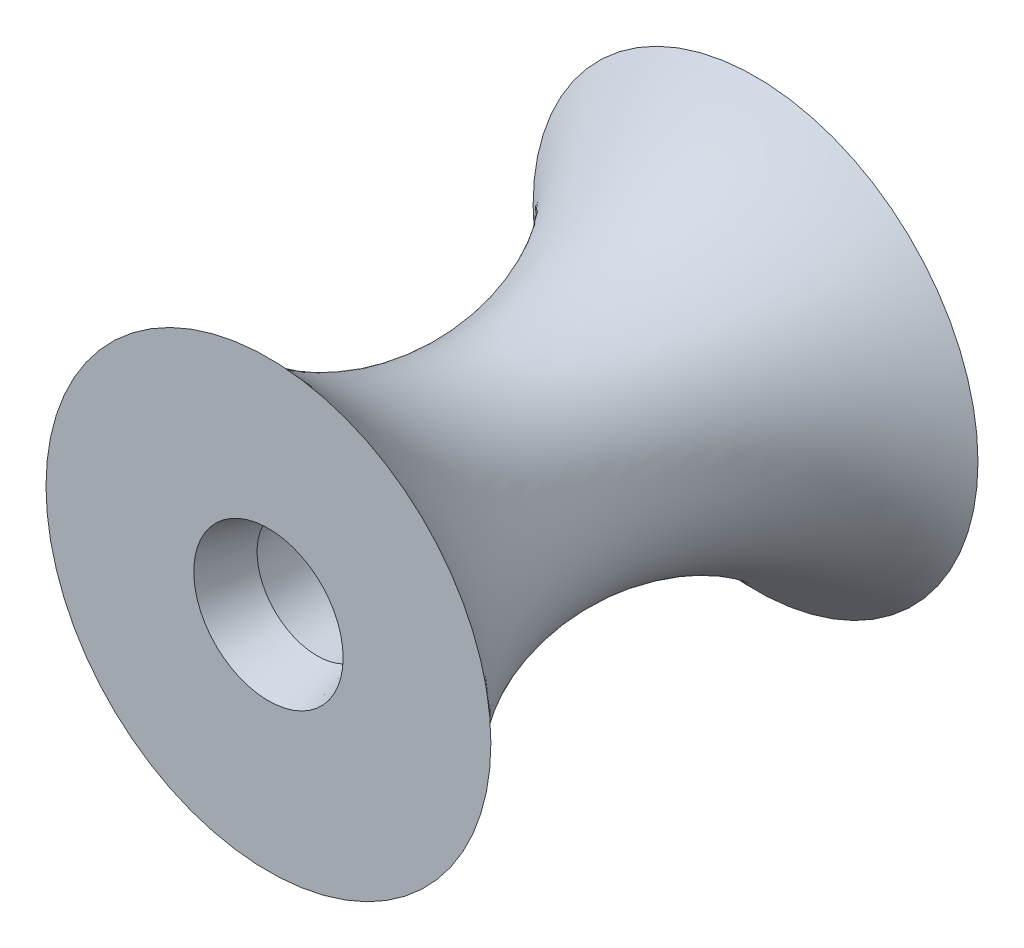
ISO-10303-21;
HEADER;
FILE_DESCRIPTION(('STEP AP214'),'2;1');
FILE_NAME('part.step','',(''),(''),'','','');
FILE_SCHEMA(('AUTOMOTIVE_DESIGN { 1 0 10303 214 1 1 1 1 }'));
ENDSEC;
DATA;
#1=APPLICATION_CONTEXT('core data for automotive mechanical design processes');
#2=APPLICATION_PROTOCOL_DEFINITION('international standard','automotive_design',2000,#1);
#3=PRODUCT_CONTEXT('',#1,'mechanical');
#4=PRODUCT('Part','Part','',(#3));
#5=PRODUCT_RELATED_PRODUCT_CATEGORY('part','',(#4));
#6=PRODUCT_DEFINITION_FORMATION('','',#4);
#7=PRODUCT_DEFINITION_CONTEXT('part definition',#1,'design');
#8=PRODUCT_DEFINITION('design','',#6,#7);
#9=PRODUCT_DEFINITION_SHAPE('','',#8);
#10=(LENGTH_UNIT() NAMED_UNIT(*) SI_UNIT(.MILLI.,.METRE.));
#11=(NAMED_UNIT(*) PLANE_ANGLE_UNIT() SI_UNIT($,.RADIAN.));
#12=(NAMED_UNIT(*) SI_UNIT($,.STERADIAN.) SOLID_ANGLE_UNIT());
#13=UNCERTAINTY_MEASURE_WITH_UNIT(LENGTH_MEASURE(1.E-05),#10,'distance_accuracy_value','');
#14=(GEOMETRIC_REPRESENTATION_CONTEXT(3) GLOBAL_UNCERTAINTY_ASSIGNED_CONTEXT((#13)) GLOBAL_UNIT_ASSIGNED_CONTEXT((#10,
#11,#12)) REPRESENTATION_CONTEXT('',''));
#15=CARTESIAN_POINT('',(0.,0.,0.));
#16=DIRECTION('',(0.,0.,1.));
#17=DIRECTION('',(1.,0.,0.));
#18=AXIS2_PLACEMENT_3D('',#15,#16,#17);
#19=CARTESIAN_POINT('',(0.,0.,-7.5));
#20=DIRECTION('',(0.,0.,1.));
#21=DIRECTION('',(1.,0.,0.));
#22=AXIS2_PLACEMENT_3D('',#19,#20,#21);
#23=TOROIDAL_SURFACE('',#22,13.1357142857143,9.78571428571429);
#24=CARTESIAN_POINT('',(0.,0.,0.));
#25=DIRECTION('',(0.,0.,1.));
#26=DIRECTION('',(1.,0.,0.));
#27=AXIS2_PLACEMENT_3D('',#24,#25,#26);
#28=CIRCLE('',#27,6.85);
#29=CARTESIAN_POINT('',(6.85,0.,0.));
#30=VERTEX_POINT('',#29);
#31=EDGE_CURVE('E10',#30,#30,#28,.T.);
#32=ORIENTED_EDGE('',*,*,#31,.F.);
#33=EDGE_LOOP('',(#32));
#34=FACE_BOUND('',#33,.T.);
#35=CARTESIAN_POINT('',(0.,0.,-15.));
#36=DIRECTION('',(0.,0.,1.));
#37=DIRECTION('',(1.,0.,0.));
#38=AXIS2_PLACEMENT_3D('',#35,#36,#37);
#39=CIRCLE('',#38,6.85);
#40=CARTESIAN_POINT('',(6.85,0.,-15.));
#41=VERTEX_POINT('',#40);
#42=EDGE_CURVE('E59',#41,#41,#39,.T.);
#43=ORIENTED_EDGE('',*,*,#42,.T.);
#44=EDGE_LOOP('',(#43));
#45=FACE_BOUND('',#44,.T.);
#46=ADVANCED_FACE('F37',(#34,#45),#23,.F.);
#47=CARTESIAN_POINT('',(-2.3,0.,0.));
#48=DIRECTION('',(0.,0.,-1.));
#49=DIRECTION('',(-1.,0.,0.));
#50=AXIS2_PLACEMENT_3D('',#47,#48,#49);
#51=PLANE('',#50);
#52=CARTESIAN_POINT('',(0.,0.,0.));
#53=DIRECTION('',(0.,0.,1.));
#54=DIRECTION('',(1.,0.,0.));
#55=AXIS2_PLACEMENT_3D('',#52,#53,#54);
#56=CIRCLE('',#55,2.3);
#57=CARTESIAN_POINT('',(2.3,0.,0.));
#58=VERTEX_POINT('',#57);
#59=EDGE_CURVE('E43',#58,#58,#56,.T.);
#60=ORIENTED_EDGE('',*,*,#59,.F.);
#61=EDGE_LOOP('',(#60));
#62=FACE_BOUND('',#61,.T.);
#63=ORIENTED_EDGE('',*,*,#31,.T.);
#64=EDGE_LOOP('',(#63));
#65=FACE_BOUND('',#64,.T.);
#66=ADVANCED_FACE('F84',(#62,#65),#51,.F.);
#67=CARTESIAN_POINT('',(0.,0.,0.));
#68=DIRECTION('',(0.,0.,1.));
#69=DIRECTION('',(1.,0.,0.));
#70=AXIS2_PLACEMENT_3D('',#67,#68,#69);
#71=CONICAL_SURFACE('',#70,2.3,0.291456794477868);
#72=CARTESIAN_POINT('',(0.,0.,-1.5));
#73=DIRECTION('',(0.,0.,1.));
#74=DIRECTION('',(1.,0.,0.));
#75=AXIS2_PLACEMENT_3D('',#72,#73,#74);
#76=CIRCLE('',#75,1.85);
#77=CARTESIAN_POINT('',(1.85,0.,-1.5));
#78=VERTEX_POINT('',#77);
#79=EDGE_CURVE('E47',#78,#78,#76,.T.);
#80=ORIENTED_EDGE('',*,*,#79,.F.);
#81=EDGE_LOOP('',(#80));
#82=FACE_BOUND('',#81,.T.);
#83=ORIENTED_EDGE('',*,*,#59,.T.);
#84=EDGE_LOOP('',(#83));
#85=FACE_BOUND('',#84,.T.);
#86=ADVANCED_FACE('F79',(#82,#85),#71,.F.);
#87=CARTESIAN_POINT('',(0.,0.,0.));
#88=DIRECTION('',(0.,0.,1.));
#89=DIRECTION('',(1.,0.,0.));
#90=AXIS2_PLACEMENT_3D('',#87,#88,#89);
#91=CYLINDRICAL_SURFACE('',#90,1.85);
#92=CARTESIAN_POINT('',(0.,0.,-13.5));
#93=DIRECTION('',(0.,0.,1.));
#94=DIRECTION('',(1.,0.,0.));
#95=AXIS2_PLACEMENT_3D('',#92,#93,#94);
#96=CIRCLE('',#95,1.85);
#97=CARTESIAN_POINT('',(1.85,0.,-13.5));
#98=VERTEX_POINT('',#97);
#99=EDGE_CURVE('E51',#98,#98,#96,.T.);
#100=ORIENTED_EDGE('',*,*,#99,.F.);
#101=EDGE_LOOP('',(#100));
#102=FACE_BOUND('',#101,.T.);
#103=ORIENTED_EDGE('',*,*,#79,.T.);
#104=EDGE_LOOP('',(#103));
#105=FACE_BOUND('',#104,.T.);
#106=ADVANCED_FACE('F73',(#102,#105),#91,.F.);
#107=CARTESIAN_POINT('',(0.,0.,-13.5));
#108=DIRECTION('',(0.,0.,-1.));
#109=DIRECTION('',(-1.,0.,0.));
#110=AXIS2_PLACEMENT_3D('',#107,#108,#109);
#111=CONICAL_SURFACE('',#110,1.85,0.291456794477867);
#112=CARTESIAN_POINT('',(0.,0.,-15.));
#113=DIRECTION('',(0.,0.,1.));
#114=DIRECTION('',(1.,0.,0.));
#115=AXIS2_PLACEMENT_3D('',#112,#113,#114);
#116=CIRCLE('',#115,2.3);
#117=CARTESIAN_POINT('',(2.3,0.,-15.));
#118=VERTEX_POINT('',#117);
#119=EDGE_CURVE('E56',#118,#118,#116,.T.);
#120=ORIENTED_EDGE('',*,*,#119,.F.);
#121=EDGE_LOOP('',(#120));
#122=FACE_BOUND('',#121,.T.);
#123=ORIENTED_EDGE('',*,*,#99,.T.);
#124=EDGE_LOOP('',(#123));
#125=FACE_BOUND('',#124,.T.);
#126=ADVANCED_FACE('F67',(#122,#125),#111,.F.);
#127=CARTESIAN_POINT('',(-2.3,0.,-15.));
#128=DIRECTION('',(0.,0.,1.));
#129=DIRECTION('',(1.,0.,0.));
#130=AXIS2_PLACEMENT_3D('',#127,#128,#129);
#131=PLANE('',#130);
#132=ORIENTED_EDGE('',*,*,#42,.F.);
#133=EDGE_LOOP('',(#132));
#134=FACE_BOUND('',#133,.T.);
#135=ORIENTED_EDGE('',*,*,#119,.T.);
#136=EDGE_LOOP('',(#135));
#137=FACE_BOUND('',#136,.T.);
#138=ADVANCED_FACE('F64',(#134,#137),#131,.F.);
#139=CLOSED_SHELL('',(#46,#66,#86,#106,#126,#138));
#140=MANIFOLD_SOLID_BREP('B2',#139);
#141=ADVANCED_BREP_SHAPE_REPRESENTATION('',(#18,#140),#14);
#142=SHAPE_DEFINITION_REPRESENTATION(#9,#141);
ENDSEC;
END-ISO-10303-21;
